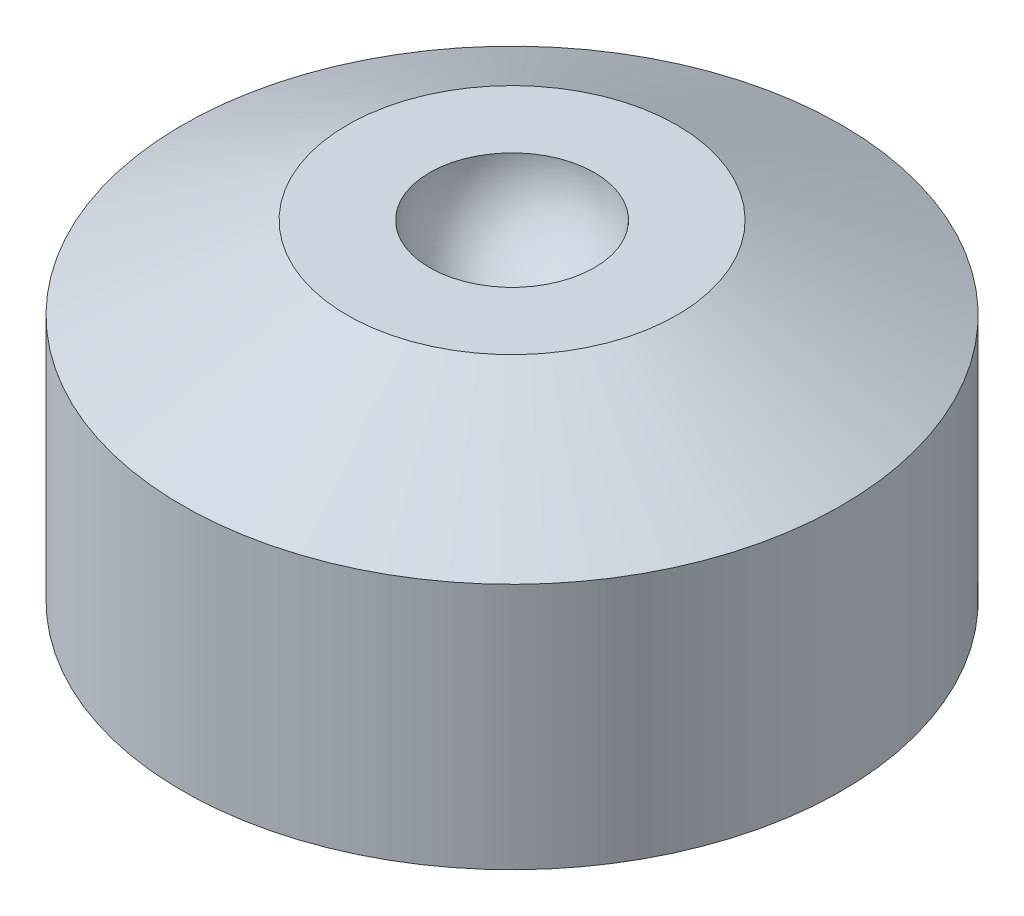
ISO-10303-21;
HEADER;
FILE_DESCRIPTION(('STEP AP214'),'2;1');
FILE_NAME('part.step','',(''),(''),'','','');
FILE_SCHEMA(('AUTOMOTIVE_DESIGN { 1 0 10303 214 1 1 1 1 }'));
ENDSEC;
DATA;
#1=APPLICATION_CONTEXT('core data for automotive mechanical design processes');
#2=APPLICATION_PROTOCOL_DEFINITION('international standard','automotive_design',2000,#1);
#3=PRODUCT_CONTEXT('',#1,'mechanical');
#4=PRODUCT('Part','Part','',(#3));
#5=PRODUCT_RELATED_PRODUCT_CATEGORY('part','',(#4));
#6=PRODUCT_DEFINITION_FORMATION('','',#4);
#7=PRODUCT_DEFINITION_CONTEXT('part definition',#1,'design');
#8=PRODUCT_DEFINITION('design','',#6,#7);
#9=PRODUCT_DEFINITION_SHAPE('','',#8);
#10=(LENGTH_UNIT() NAMED_UNIT(*) SI_UNIT(.MILLI.,.METRE.));
#11=(NAMED_UNIT(*) PLANE_ANGLE_UNIT() SI_UNIT($,.RADIAN.));
#12=(NAMED_UNIT(*) SI_UNIT($,.STERADIAN.) SOLID_ANGLE_UNIT());
#13=UNCERTAINTY_MEASURE_WITH_UNIT(LENGTH_MEASURE(1.E-05),#10,'distance_accuracy_value','');
#14=(GEOMETRIC_REPRESENTATION_CONTEXT(3) GLOBAL_UNCERTAINTY_ASSIGNED_CONTEXT((#13)) GLOBAL_UNIT_ASSIGNED_CONTEXT((#10,
#11,#12)) REPRESENTATION_CONTEXT('',''));
#15=CARTESIAN_POINT('',(0.,0.,0.));
#16=DIRECTION('',(0.,0.,1.));
#17=DIRECTION('',(1.,0.,0.));
#18=AXIS2_PLACEMENT_3D('',#15,#16,#17);
#19=CARTESIAN_POINT('',(0.,0.,0.));
#20=DIRECTION('',(0.,1.,0.));
#21=DIRECTION('',(0.,0.,1.));
#22=AXIS2_PLACEMENT_3D('',#19,#20,#21);
#23=PLANE('',#22);
#24=CARTESIAN_POINT('',(0.,0.,0.));
#25=DIRECTION('',(0.,-1.,0.));
#26=DIRECTION('',(0.,0.,-1.));
#27=AXIS2_PLACEMENT_3D('',#24,#25,#26);
#28=CIRCLE('',#27,25.4);
#29=CARTESIAN_POINT('',(0.,0.,-25.4));
#30=VERTEX_POINT('',#29);
#31=EDGE_CURVE('E45',#30,#30,#28,.T.);
#32=ORIENTED_EDGE('',*,*,#31,.T.);
#33=EDGE_LOOP('',(#32));
#34=FACE_BOUND('',#33,.T.);
#35=ADVANCED_FACE('F31',(#34),#23,.F.);
#36=CARTESIAN_POINT('',(0.,25.4,0.));
#37=DIRECTION('',(0.,-1.,0.));
#38=DIRECTION('',(0.,0.,1.));
#39=AXIS2_PLACEMENT_3D('',#36,#37,#38);
#40=SPHERICAL_SURFACE('',#39,6.35);
#41=CARTESIAN_POINT('',(0.,25.4,0.));
#42=DIRECTION('',(0.,-1.,0.));
#43=DIRECTION('',(0.,0.,-1.));
#44=AXIS2_PLACEMENT_3D('',#41,#42,#43);
#45=CIRCLE('',#44,6.35);
#46=CARTESIAN_POINT('',(0.,25.4,-6.35));
#47=VERTEX_POINT('',#46);
#48=EDGE_CURVE('E10',#47,#47,#45,.T.);
#49=ORIENTED_EDGE('',*,*,#48,.F.);
#50=EDGE_LOOP('',(#49));
#51=FACE_BOUND('',#50,.T.);
#52=ADVANCED_FACE('F65',(#51),#40,.F.);
#53=CARTESIAN_POINT('',(0.,25.4,12.7));
#54=DIRECTION('',(0.,-1.,0.));
#55=DIRECTION('',(0.,0.,-1.));
#56=AXIS2_PLACEMENT_3D('',#53,#54,#55);
#57=PLANE('',#56);
#58=CARTESIAN_POINT('',(0.,25.4,0.));
#59=DIRECTION('',(0.,-1.,0.));
#60=DIRECTION('',(0.,0.,-1.));
#61=AXIS2_PLACEMENT_3D('',#58,#59,#60);
#62=CIRCLE('',#61,12.7);
#63=CARTESIAN_POINT('',(0.,25.4,-12.7));
#64=VERTEX_POINT('',#63);
#65=EDGE_CURVE('E37',#64,#64,#62,.T.);
#66=ORIENTED_EDGE('',*,*,#65,.F.);
#67=EDGE_LOOP('',(#66));
#68=FACE_BOUND('',#67,.T.);
#69=ORIENTED_EDGE('',*,*,#48,.T.);
#70=EDGE_LOOP('',(#69));
#71=FACE_BOUND('',#70,.T.);
#72=ADVANCED_FACE('F60',(#68,#71),#57,.F.);
#73=CARTESIAN_POINT('',(0.,25.4,0.));
#74=DIRECTION('',(0.,-1.,0.));
#75=DIRECTION('',(0.,0.,-1.));
#76=AXIS2_PLACEMENT_3D('',#73,#74,#75);
#77=CONICAL_SURFACE('',#76,12.7,1.10714871779409);
#78=CARTESIAN_POINT('',(0.,19.05,0.));
#79=DIRECTION('',(0.,-1.,0.));
#80=DIRECTION('',(0.,0.,-1.));
#81=AXIS2_PLACEMENT_3D('',#78,#79,#80);
#82=CIRCLE('',#81,25.4);
#83=CARTESIAN_POINT('',(0.,19.05,-25.4));
#84=VERTEX_POINT('',#83);
#85=EDGE_CURVE('E41',#84,#84,#82,.T.);
#86=ORIENTED_EDGE('',*,*,#85,.F.);
#87=EDGE_LOOP('',(#86));
#88=FACE_BOUND('',#87,.T.);
#89=ORIENTED_EDGE('',*,*,#65,.T.);
#90=EDGE_LOOP('',(#89));
#91=FACE_BOUND('',#90,.T.);
#92=ADVANCED_FACE('F55',(#88,#91),#77,.T.);
#93=CARTESIAN_POINT('',(0.,0.,0.));
#94=DIRECTION('',(0.,-1.,0.));
#95=DIRECTION('',(0.,0.,-1.));
#96=AXIS2_PLACEMENT_3D('',#93,#94,#95);
#97=CYLINDRICAL_SURFACE('',#96,25.4);
#98=ORIENTED_EDGE('',*,*,#31,.F.);
#99=EDGE_LOOP('',(#98));
#100=FACE_BOUND('',#99,.T.);
#101=ORIENTED_EDGE('',*,*,#85,.T.);
#102=EDGE_LOOP('',(#101));
#103=FACE_BOUND('',#102,.T.);
#104=ADVANCED_FACE('F52',(#100,#103),#97,.T.);
#105=CLOSED_SHELL('',(#35,#52,#72,#92,#104));
#106=MANIFOLD_SOLID_BREP('B2',#105);
#107=ADVANCED_BREP_SHAPE_REPRESENTATION('',(#18,#106),#14);
#108=SHAPE_DEFINITION_REPRESENTATION(#9,#107);
ENDSEC;
END-ISO-10303-21;
